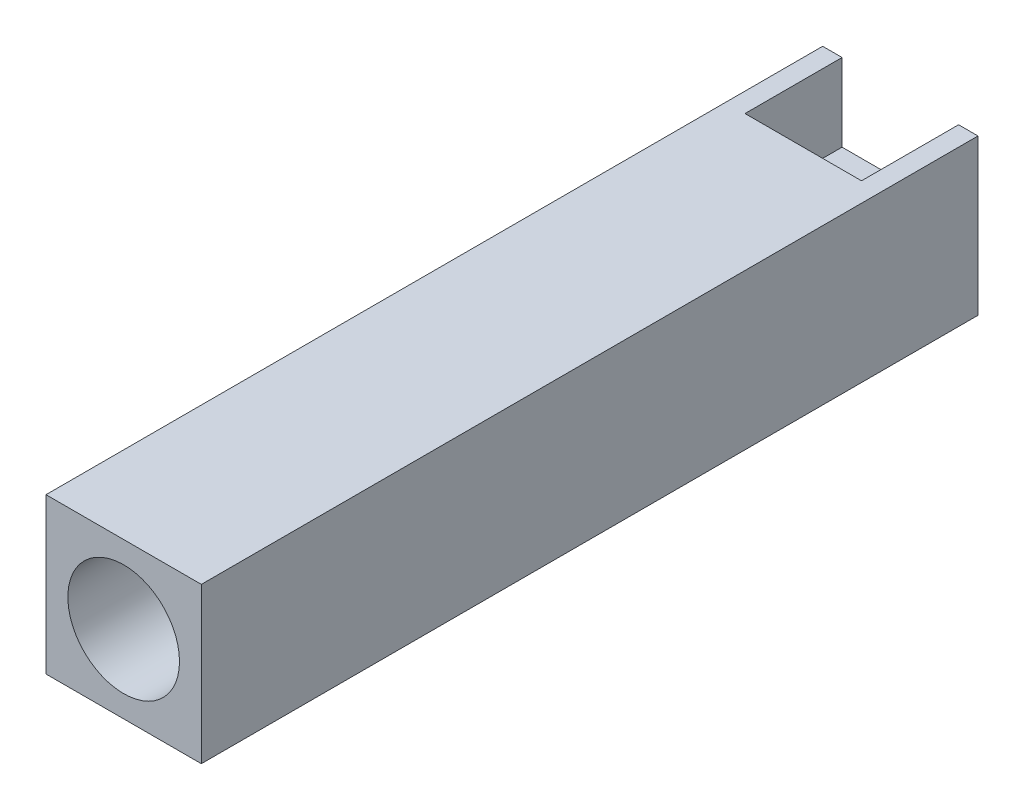
ISO-10303-21;
HEADER;
FILE_DESCRIPTION(('STEP AP214'),'2;1');
FILE_NAME('part.step','',(''),(''),'','','');
FILE_SCHEMA(('AUTOMOTIVE_DESIGN { 1 0 10303 214 1 1 1 1 }'));
ENDSEC;
DATA;
#1=APPLICATION_CONTEXT('core data for automotive mechanical design processes');
#2=APPLICATION_PROTOCOL_DEFINITION('international standard','automotive_design',2000,#1);
#3=PRODUCT_CONTEXT('',#1,'mechanical');
#4=PRODUCT('Part','Part','',(#3));
#5=PRODUCT_RELATED_PRODUCT_CATEGORY('part','',(#4));
#6=PRODUCT_DEFINITION_FORMATION('','',#4);
#7=PRODUCT_DEFINITION_CONTEXT('part definition',#1,'design');
#8=PRODUCT_DEFINITION('design','',#6,#7);
#9=PRODUCT_DEFINITION_SHAPE('','',#8);
#10=(LENGTH_UNIT() NAMED_UNIT(*) SI_UNIT(.MILLI.,.METRE.));
#11=(NAMED_UNIT(*) PLANE_ANGLE_UNIT() SI_UNIT($,.RADIAN.));
#12=(NAMED_UNIT(*) SI_UNIT($,.STERADIAN.) SOLID_ANGLE_UNIT());
#13=UNCERTAINTY_MEASURE_WITH_UNIT(LENGTH_MEASURE(1.E-05),#10,'distance_accuracy_value','');
#14=(GEOMETRIC_REPRESENTATION_CONTEXT(3) GLOBAL_UNCERTAINTY_ASSIGNED_CONTEXT((#13)) GLOBAL_UNIT_ASSIGNED_CONTEXT((#10,
#11,#12)) REPRESENTATION_CONTEXT('',''));
#15=CARTESIAN_POINT('',(0.,0.,0.));
#16=DIRECTION('',(0.,0.,1.));
#17=DIRECTION('',(1.,0.,0.));
#18=AXIS2_PLACEMENT_3D('',#15,#16,#17);
#19=CARTESIAN_POINT('',(0.,0.,80.));
#20=DIRECTION('',(1.,0.,0.));
#21=DIRECTION('',(0.,1.,0.));
#22=AXIS2_PLACEMENT_3D('',#19,#20,#21);
#23=PLANE('',#22);
#24=DIRECTION('',(0.,-1.,0.));
#25=VECTOR('',#24,1.);
#26=CARTESIAN_POINT('',(0.,0.,0.));
#27=LINE('',#26,#25);
#28=CARTESIAN_POINT('',(0.,0.,0.));
#29=VERTEX_POINT('',#28);
#30=CARTESIAN_POINT('',(0.,-16.,0.));
#31=VERTEX_POINT('',#30);
#32=EDGE_CURVE('E221',#29,#31,#27,.T.);
#33=ORIENTED_EDGE('',*,*,#32,.T.);
#34=DIRECTION('',(0.,0.,-1.));
#35=VECTOR('',#34,1.);
#36=CARTESIAN_POINT('',(0.,-16.,80.));
#37=LINE('',#36,#35);
#38=CARTESIAN_POINT('',(0.,-16.,80.));
#39=VERTEX_POINT('',#38);
#40=EDGE_CURVE('E11',#39,#31,#37,.T.);
#41=ORIENTED_EDGE('',*,*,#40,.F.);
#42=DIRECTION('',(0.,-1.,0.));
#43=VECTOR('',#42,1.);
#44=CARTESIAN_POINT('',(0.,0.,80.));
#45=LINE('',#44,#43);
#46=CARTESIAN_POINT('',(0.,0.,80.));
#47=VERTEX_POINT('',#46);
#48=EDGE_CURVE('E225',#47,#39,#45,.T.);
#49=ORIENTED_EDGE('',*,*,#48,.F.);
#50=DIRECTION('',(0.,0.,-1.));
#51=VECTOR('',#50,1.);
#52=CARTESIAN_POINT('',(0.,0.,80.));
#53=LINE('',#52,#51);
#54=EDGE_CURVE('E239',#47,#29,#53,.T.);
#55=ORIENTED_EDGE('',*,*,#54,.T.);
#56=EDGE_LOOP('',(#33,#41,#49,#55));
#57=FACE_BOUND('',#56,.T.);
#58=ADVANCED_FACE('F39',(#57),#23,.F.);
#59=CARTESIAN_POINT('',(0.,-16.,80.));
#60=DIRECTION('',(0.,1.,0.));
#61=DIRECTION('',(0.,0.,1.));
#62=AXIS2_PLACEMENT_3D('',#59,#60,#61);
#63=PLANE('',#62);
#64=DIRECTION('',(1.,0.,0.));
#65=VECTOR('',#64,1.);
#66=CARTESIAN_POINT('',(0.,-16.,0.));
#67=LINE('',#66,#65);
#68=CARTESIAN_POINT('',(2.,-16.,0.));
#69=VERTEX_POINT('',#68);
#70=EDGE_CURVE('E244',#31,#69,#67,.T.);
#71=ORIENTED_EDGE('',*,*,#70,.T.);
#72=DIRECTION('',(0.,0.,-1.));
#73=VECTOR('',#72,1.);
#74=CARTESIAN_POINT('',(2.,-16.,10.));
#75=LINE('',#74,#73);
#76=CARTESIAN_POINT('',(2.,-16.,10.));
#77=VERTEX_POINT('',#76);
#78=EDGE_CURVE('E166',#77,#69,#75,.T.);
#79=ORIENTED_EDGE('',*,*,#78,.F.);
#80=DIRECTION('',(-1.,0.,0.));
#81=VECTOR('',#80,1.);
#82=CARTESIAN_POINT('',(14.,-16.,10.));
#83=LINE('',#82,#81);
#84=CARTESIAN_POINT('',(14.,-16.,10.));
#85=VERTEX_POINT('',#84);
#86=EDGE_CURVE('E192',#85,#77,#83,.T.);
#87=ORIENTED_EDGE('',*,*,#86,.F.);
#88=DIRECTION('',(0.,0.,-1.));
#89=VECTOR('',#88,1.);
#90=CARTESIAN_POINT('',(14.,-16.,10.));
#91=LINE('',#90,#89);
#92=CARTESIAN_POINT('',(14.,-16.,0.));
#93=VERTEX_POINT('',#92);
#94=EDGE_CURVE('E208',#85,#93,#91,.T.);
#95=ORIENTED_EDGE('',*,*,#94,.T.);
#96=CARTESIAN_POINT('',(16.,-16.,0.));
#97=VERTEX_POINT('',#96);
#98=EDGE_CURVE('E243',#93,#97,#67,.T.);
#99=ORIENTED_EDGE('',*,*,#98,.T.);
#100=DIRECTION('',(0.,0.,-1.));
#101=VECTOR('',#100,1.);
#102=CARTESIAN_POINT('',(16.,-16.,80.));
#103=LINE('',#102,#101);
#104=CARTESIAN_POINT('',(16.,-16.,80.));
#105=VERTEX_POINT('',#104);
#106=EDGE_CURVE('E47',#105,#97,#103,.T.);
#107=ORIENTED_EDGE('',*,*,#106,.F.);
#108=DIRECTION('',(1.,0.,0.));
#109=VECTOR('',#108,1.);
#110=CARTESIAN_POINT('',(0.,-16.,80.));
#111=LINE('',#110,#109);
#112=EDGE_CURVE('E229',#39,#105,#111,.T.);
#113=ORIENTED_EDGE('',*,*,#112,.F.);
#114=ORIENTED_EDGE('',*,*,#40,.T.);
#115=EDGE_LOOP('',(#71,#79,#87,#95,#99,#107,#113,#114));
#116=FACE_BOUND('',#115,.T.);
#117=ADVANCED_FACE('F283',(#116),#63,.F.);
#118=CARTESIAN_POINT('',(16.,0.,80.));
#119=DIRECTION('',(-1.,0.,0.));
#120=DIRECTION('',(0.,-1.,0.));
#121=AXIS2_PLACEMENT_3D('',#118,#119,#120);
#122=PLANE('',#121);
#123=DIRECTION('',(0.,1.,0.));
#124=VECTOR('',#123,1.);
#125=CARTESIAN_POINT('',(16.,0.,0.));
#126=LINE('',#125,#124);
#127=CARTESIAN_POINT('',(16.,0.,0.));
#128=VERTEX_POINT('',#127);
#129=EDGE_CURVE('E248',#97,#128,#126,.T.);
#130=ORIENTED_EDGE('',*,*,#129,.T.);
#131=DIRECTION('',(0.,0.,-1.));
#132=VECTOR('',#131,1.);
#133=CARTESIAN_POINT('',(16.,0.,80.));
#134=LINE('',#133,#132);
#135=CARTESIAN_POINT('',(16.,0.,80.));
#136=VERTEX_POINT('',#135);
#137=EDGE_CURVE('E258',#136,#128,#134,.T.);
#138=ORIENTED_EDGE('',*,*,#137,.F.);
#139=DIRECTION('',(0.,1.,0.));
#140=VECTOR('',#139,1.);
#141=CARTESIAN_POINT('',(16.,0.,80.));
#142=LINE('',#141,#140);
#143=EDGE_CURVE('E233',#105,#136,#142,.T.);
#144=ORIENTED_EDGE('',*,*,#143,.F.);
#145=ORIENTED_EDGE('',*,*,#106,.T.);
#146=EDGE_LOOP('',(#130,#138,#144,#145));
#147=FACE_BOUND('',#146,.T.);
#148=ADVANCED_FACE('F267',(#147),#122,.F.);
#149=CARTESIAN_POINT('',(0.,0.,80.));
#150=DIRECTION('',(0.,-1.,0.));
#151=DIRECTION('',(0.,0.,-1.));
#152=AXIS2_PLACEMENT_3D('',#149,#150,#151);
#153=PLANE('',#152);
#154=DIRECTION('',(-1.,0.,0.));
#155=VECTOR('',#154,1.);
#156=CARTESIAN_POINT('',(0.,0.,0.));
#157=LINE('',#156,#155);
#158=CARTESIAN_POINT('',(14.,0.,0.));
#159=VERTEX_POINT('',#158);
#160=EDGE_CURVE('E230',#128,#159,#157,.T.);
#161=ORIENTED_EDGE('',*,*,#160,.T.);
#162=DIRECTION('',(0.,0.,-1.));
#163=VECTOR('',#162,1.);
#164=CARTESIAN_POINT('',(14.,0.,10.));
#165=LINE('',#164,#163);
#166=CARTESIAN_POINT('',(14.,0.,10.));
#167=VERTEX_POINT('',#166);
#168=EDGE_CURVE('E169',#167,#159,#165,.T.);
#169=ORIENTED_EDGE('',*,*,#168,.F.);
#170=DIRECTION('',(1.,0.,0.));
#171=VECTOR('',#170,1.);
#172=CARTESIAN_POINT('',(14.,0.,10.));
#173=LINE('',#172,#171);
#174=CARTESIAN_POINT('',(2.,0.,10.));
#175=VERTEX_POINT('',#174);
#176=EDGE_CURVE('E136',#175,#167,#173,.T.);
#177=ORIENTED_EDGE('',*,*,#176,.F.);
#178=DIRECTION('',(0.,0.,-1.));
#179=VECTOR('',#178,1.);
#180=CARTESIAN_POINT('',(2.,0.,10.));
#181=LINE('',#180,#179);
#182=CARTESIAN_POINT('',(2.,0.,0.));
#183=VERTEX_POINT('',#182);
#184=EDGE_CURVE('E173',#175,#183,#181,.T.);
#185=ORIENTED_EDGE('',*,*,#184,.T.);
#186=EDGE_CURVE('E251',#183,#29,#157,.T.);
#187=ORIENTED_EDGE('',*,*,#186,.T.);
#188=ORIENTED_EDGE('',*,*,#54,.F.);
#189=DIRECTION('',(-1.,0.,0.));
#190=VECTOR('',#189,1.);
#191=CARTESIAN_POINT('',(0.,0.,80.));
#192=LINE('',#191,#190);
#193=EDGE_CURVE('E236',#136,#47,#192,.T.);
#194=ORIENTED_EDGE('',*,*,#193,.F.);
#195=ORIENTED_EDGE('',*,*,#137,.T.);
#196=EDGE_LOOP('',(#161,#169,#177,#185,#187,#188,#194,#195));
#197=FACE_BOUND('',#196,.T.);
#198=ADVANCED_FACE('F276',(#197),#153,.F.);
#199=CARTESIAN_POINT('',(0.,0.,80.));
#200=DIRECTION('',(0.,0.,1.));
#201=DIRECTION('',(1.,0.,0.));
#202=AXIS2_PLACEMENT_3D('',#199,#200,#201);
#203=PLANE('',#202);
#204=CARTESIAN_POINT('',(8.,-8.,80.));
#205=DIRECTION('',(0.,0.,1.));
#206=DIRECTION('',(1.,0.,0.));
#207=AXIS2_PLACEMENT_3D('',#204,#205,#206);
#208=CIRCLE('',#207,5.75);
#209=CARTESIAN_POINT('',(13.75,-8.,80.));
#210=VERTEX_POINT('',#209);
#211=EDGE_CURVE('E172',#210,#210,#208,.T.);
#212=ORIENTED_EDGE('',*,*,#211,.F.);
#213=EDGE_LOOP('',(#212));
#214=FACE_BOUND('',#213,.T.);
#215=ORIENTED_EDGE('',*,*,#48,.T.);
#216=ORIENTED_EDGE('',*,*,#112,.T.);
#217=ORIENTED_EDGE('',*,*,#143,.T.);
#218=ORIENTED_EDGE('',*,*,#193,.T.);
#219=EDGE_LOOP('',(#215,#216,#217,#218));
#220=FACE_BOUND('',#219,.T.);
#221=ADVANCED_FACE('F281',(#214,#220),#203,.T.);
#222=CARTESIAN_POINT('',(0.,0.,0.));
#223=DIRECTION('',(0.,0.,1.));
#224=DIRECTION('',(1.,0.,0.));
#225=AXIS2_PLACEMENT_3D('',#222,#223,#224);
#226=PLANE('',#225);
#227=DIRECTION('',(-1.,0.,0.));
#228=VECTOR('',#227,1.);
#229=CARTESIAN_POINT('',(14.,-8.,0.));
#230=LINE('',#229,#228);
#231=CARTESIAN_POINT('',(14.,-8.,0.));
#232=VERTEX_POINT('',#231);
#233=CARTESIAN_POINT('',(2.,-8.,0.));
#234=VERTEX_POINT('',#233);
#235=EDGE_CURVE('E154',#232,#234,#230,.T.);
#236=ORIENTED_EDGE('',*,*,#235,.F.);
#237=DIRECTION('',(0.,-1.,0.));
#238=VECTOR('',#237,1.);
#239=CARTESIAN_POINT('',(14.,0.,0.));
#240=LINE('',#239,#238);
#241=EDGE_CURVE('E54',#159,#232,#240,.T.);
#242=ORIENTED_EDGE('',*,*,#241,.F.);
#243=ORIENTED_EDGE('',*,*,#160,.F.);
#244=ORIENTED_EDGE('',*,*,#129,.F.);
#245=ORIENTED_EDGE('',*,*,#98,.F.);
#246=DIRECTION('',(0.,-1.,0.));
#247=VECTOR('',#246,1.);
#248=CARTESIAN_POINT('',(14.,-13.,0.));
#249=LINE('',#248,#247);
#250=CARTESIAN_POINT('',(14.,-13.,0.));
#251=VERTEX_POINT('',#250);
#252=EDGE_CURVE('E184',#251,#93,#249,.T.);
#253=ORIENTED_EDGE('',*,*,#252,.F.);
#254=DIRECTION('',(1.,0.,0.));
#255=VECTOR('',#254,1.);
#256=CARTESIAN_POINT('',(14.,-13.,0.));
#257=LINE('',#256,#255);
#258=CARTESIAN_POINT('',(2.,-13.,0.));
#259=VERTEX_POINT('',#258);
#260=EDGE_CURVE('E199',#259,#251,#257,.T.);
#261=ORIENTED_EDGE('',*,*,#260,.F.);
#262=DIRECTION('',(0.,1.,0.));
#263=VECTOR('',#262,1.);
#264=CARTESIAN_POINT('',(2.,-13.,0.));
#265=LINE('',#264,#263);
#266=EDGE_CURVE('E62',#69,#259,#265,.T.);
#267=ORIENTED_EDGE('',*,*,#266,.F.);
#268=ORIENTED_EDGE('',*,*,#70,.F.);
#269=ORIENTED_EDGE('',*,*,#32,.F.);
#270=ORIENTED_EDGE('',*,*,#186,.F.);
#271=DIRECTION('',(0.,1.,0.));
#272=VECTOR('',#271,1.);
#273=CARTESIAN_POINT('',(2.,0.,0.));
#274=LINE('',#273,#272);
#275=EDGE_CURVE('E151',#234,#183,#274,.T.);
#276=ORIENTED_EDGE('',*,*,#275,.F.);
#277=EDGE_LOOP('',(#236,#242,#243,#244,#245,#253,#261,#267,#268,#269,#270,#276));
#278=FACE_BOUND('',#277,.T.);
#279=ADVANCED_FACE('F273',(#278),#226,.F.);
#280=CARTESIAN_POINT('',(8.,-8.,30.));
#281=DIRECTION('',(0.,0.,1.));
#282=DIRECTION('',(1.,0.,0.));
#283=AXIS2_PLACEMENT_3D('',#280,#281,#282);
#284=CYLINDRICAL_SURFACE('',#283,5.75);
#285=CARTESIAN_POINT('',(8.,-8.,30.));
#286=DIRECTION('',(0.,0.,1.));
#287=DIRECTION('',(1.,0.,0.));
#288=AXIS2_PLACEMENT_3D('',#285,#286,#287);
#289=CIRCLE('',#288,5.75);
#290=CARTESIAN_POINT('',(13.75,-8.,30.));
#291=VERTEX_POINT('',#290);
#292=EDGE_CURVE('E217',#291,#291,#289,.T.);
#293=ORIENTED_EDGE('',*,*,#292,.F.);
#294=EDGE_LOOP('',(#293));
#295=FACE_BOUND('',#294,.T.);
#296=ORIENTED_EDGE('',*,*,#211,.T.);
#297=EDGE_LOOP('',(#296));
#298=FACE_BOUND('',#297,.T.);
#299=ADVANCED_FACE('F324',(#295,#298),#284,.F.);
#300=CARTESIAN_POINT('',(8.,-8.,30.));
#301=DIRECTION('',(0.,0.,1.));
#302=DIRECTION('',(1.,0.,0.));
#303=AXIS2_PLACEMENT_3D('',#300,#301,#302);
#304=PLANE('',#303);
#305=ORIENTED_EDGE('',*,*,#292,.T.);
#306=EDGE_LOOP('',(#305));
#307=FACE_BOUND('',#306,.T.);
#308=ADVANCED_FACE('F308',(#307),#304,.T.);
#309=CARTESIAN_POINT('',(2.,-13.,10.));
#310=DIRECTION('',(-1.,0.,0.));
#311=DIRECTION('',(0.,0.,1.));
#312=AXIS2_PLACEMENT_3D('',#309,#310,#311);
#313=PLANE('',#312);
#314=ORIENTED_EDGE('',*,*,#266,.T.);
#315=DIRECTION('',(0.,0.,-1.));
#316=VECTOR('',#315,1.);
#317=CARTESIAN_POINT('',(2.,-13.,10.));
#318=LINE('',#317,#316);
#319=CARTESIAN_POINT('',(2.,-13.,10.));
#320=VERTEX_POINT('',#319);
#321=EDGE_CURVE('E196',#320,#259,#318,.T.);
#322=ORIENTED_EDGE('',*,*,#321,.F.);
#323=DIRECTION('',(0.,1.,0.));
#324=VECTOR('',#323,1.);
#325=CARTESIAN_POINT('',(2.,-13.,10.));
#326=LINE('',#325,#324);
#327=EDGE_CURVE('E179',#77,#320,#326,.T.);
#328=ORIENTED_EDGE('',*,*,#327,.F.);
#329=ORIENTED_EDGE('',*,*,#78,.T.);
#330=EDGE_LOOP('',(#314,#322,#328,#329));
#331=FACE_BOUND('',#330,.T.);
#332=ADVANCED_FACE('F294',(#331),#313,.F.);
#333=CARTESIAN_POINT('',(14.,-13.,10.));
#334=DIRECTION('',(1.,0.,0.));
#335=DIRECTION('',(0.,0.,-1.));
#336=AXIS2_PLACEMENT_3D('',#333,#334,#335);
#337=PLANE('',#336);
#338=ORIENTED_EDGE('',*,*,#252,.T.);
#339=ORIENTED_EDGE('',*,*,#94,.F.);
#340=DIRECTION('',(0.,-1.,0.));
#341=VECTOR('',#340,1.);
#342=CARTESIAN_POINT('',(14.,-13.,10.));
#343=LINE('',#342,#341);
#344=CARTESIAN_POINT('',(14.,-13.,10.));
#345=VERTEX_POINT('',#344);
#346=EDGE_CURVE('E188',#345,#85,#343,.T.);
#347=ORIENTED_EDGE('',*,*,#346,.F.);
#348=DIRECTION('',(0.,0.,-1.));
#349=VECTOR('',#348,1.);
#350=CARTESIAN_POINT('',(14.,-13.,10.));
#351=LINE('',#350,#349);
#352=EDGE_CURVE('E212',#345,#251,#351,.T.);
#353=ORIENTED_EDGE('',*,*,#352,.T.);
#354=EDGE_LOOP('',(#338,#339,#347,#353));
#355=FACE_BOUND('',#354,.T.);
#356=ADVANCED_FACE('F299',(#355),#337,.F.);
#357=CARTESIAN_POINT('',(14.,-13.,10.));
#358=DIRECTION('',(0.,1.,0.));
#359=DIRECTION('',(0.,0.,1.));
#360=AXIS2_PLACEMENT_3D('',#357,#358,#359);
#361=PLANE('',#360);
#362=CARTESIAN_POINT('',(8.,-13.,5.));
#363=DIRECTION('',(0.,-1.,0.));
#364=DIRECTION('',(0.,0.,-1.));
#365=AXIS2_PLACEMENT_3D('',#362,#363,#364);
#366=CIRCLE('',#365,3.25);
#367=CARTESIAN_POINT('',(8.,-13.,1.75));
#368=VERTEX_POINT('',#367);
#369=EDGE_CURVE('E157',#368,#368,#366,.T.);
#370=ORIENTED_EDGE('',*,*,#369,.F.);
#371=EDGE_LOOP('',(#370));
#372=FACE_BOUND('',#371,.T.);
#373=ORIENTED_EDGE('',*,*,#260,.T.);
#374=ORIENTED_EDGE('',*,*,#352,.F.);
#375=DIRECTION('',(1.,0.,0.));
#376=VECTOR('',#375,1.);
#377=CARTESIAN_POINT('',(14.,-13.,10.));
#378=LINE('',#377,#376);
#379=EDGE_CURVE('E183',#320,#345,#378,.T.);
#380=ORIENTED_EDGE('',*,*,#379,.F.);
#381=ORIENTED_EDGE('',*,*,#321,.T.);
#382=EDGE_LOOP('',(#373,#374,#380,#381));
#383=FACE_BOUND('',#382,.T.);
#384=ADVANCED_FACE('F291',(#372,#383),#361,.F.);
#385=CARTESIAN_POINT('',(0.,0.,10.));
#386=DIRECTION('',(0.,0.,-1.));
#387=DIRECTION('',(-1.,0.,0.));
#388=AXIS2_PLACEMENT_3D('',#385,#386,#387);
#389=PLANE('',#388);
#390=ORIENTED_EDGE('',*,*,#327,.T.);
#391=ORIENTED_EDGE('',*,*,#379,.T.);
#392=ORIENTED_EDGE('',*,*,#346,.T.);
#393=ORIENTED_EDGE('',*,*,#86,.T.);
#394=EDGE_LOOP('',(#390,#391,#392,#393));
#395=FACE_BOUND('',#394,.T.);
#396=ADVANCED_FACE('F297',(#395),#389,.T.);
#397=CARTESIAN_POINT('',(14.,0.,10.));
#398=DIRECTION('',(1.,0.,0.));
#399=DIRECTION('',(0.,1.,0.));
#400=AXIS2_PLACEMENT_3D('',#397,#398,#399);
#401=PLANE('',#400);
#402=ORIENTED_EDGE('',*,*,#241,.T.);
#403=DIRECTION('',(0.,0.,-1.));
#404=VECTOR('',#403,1.);
#405=CARTESIAN_POINT('',(14.,-8.,10.));
#406=LINE('',#405,#404);
#407=CARTESIAN_POINT('',(14.,-8.,10.));
#408=VERTEX_POINT('',#407);
#409=EDGE_CURVE('E125',#408,#232,#406,.T.);
#410=ORIENTED_EDGE('',*,*,#409,.F.);
#411=DIRECTION('',(0.,-1.,0.));
#412=VECTOR('',#411,1.);
#413=CARTESIAN_POINT('',(14.,0.,10.));
#414=LINE('',#413,#412);
#415=EDGE_CURVE('E129',#167,#408,#414,.T.);
#416=ORIENTED_EDGE('',*,*,#415,.F.);
#417=ORIENTED_EDGE('',*,*,#168,.T.);
#418=EDGE_LOOP('',(#402,#410,#416,#417));
#419=FACE_BOUND('',#418,.T.);
#420=ADVANCED_FACE('F127',(#419),#401,.F.);
#421=CARTESIAN_POINT('',(2.,0.,10.));
#422=DIRECTION('',(-1.,0.,0.));
#423=DIRECTION('',(0.,-1.,0.));
#424=AXIS2_PLACEMENT_3D('',#421,#422,#423);
#425=PLANE('',#424);
#426=ORIENTED_EDGE('',*,*,#275,.T.);
#427=ORIENTED_EDGE('',*,*,#184,.F.);
#428=DIRECTION('',(0.,1.,0.));
#429=VECTOR('',#428,1.);
#430=CARTESIAN_POINT('',(2.,0.,10.));
#431=LINE('',#430,#429);
#432=CARTESIAN_POINT('',(2.,-8.,10.));
#433=VERTEX_POINT('',#432);
#434=EDGE_CURVE('E145',#433,#175,#431,.T.);
#435=ORIENTED_EDGE('',*,*,#434,.F.);
#436=DIRECTION('',(0.,0.,-1.));
#437=VECTOR('',#436,1.);
#438=CARTESIAN_POINT('',(2.,-8.,10.));
#439=LINE('',#438,#437);
#440=EDGE_CURVE('E135',#433,#234,#439,.T.);
#441=ORIENTED_EDGE('',*,*,#440,.T.);
#442=EDGE_LOOP('',(#426,#427,#435,#441));
#443=FACE_BOUND('',#442,.T.);
#444=ADVANCED_FACE('F369',(#443),#425,.F.);
#445=CARTESIAN_POINT('',(14.,-8.,10.));
#446=DIRECTION('',(0.,-1.,0.));
#447=DIRECTION('',(0.,0.,-1.));
#448=AXIS2_PLACEMENT_3D('',#445,#446,#447);
#449=PLANE('',#448);
#450=CARTESIAN_POINT('',(8.,-8.,5.));
#451=DIRECTION('',(0.,-1.,0.));
#452=DIRECTION('',(0.,0.,-1.));
#453=AXIS2_PLACEMENT_3D('',#450,#451,#452);
#454=CIRCLE('',#453,1.64999999999999);
#455=CARTESIAN_POINT('',(8.,-8.,3.35000000000001));
#456=VERTEX_POINT('',#455);
#457=EDGE_CURVE('E437',#456,#456,#454,.T.);
#458=ORIENTED_EDGE('',*,*,#457,.T.);
#459=EDGE_LOOP('',(#458));
#460=FACE_BOUND('',#459,.T.);
#461=ORIENTED_EDGE('',*,*,#235,.T.);
#462=ORIENTED_EDGE('',*,*,#440,.F.);
#463=DIRECTION('',(-1.,0.,0.));
#464=VECTOR('',#463,1.);
#465=CARTESIAN_POINT('',(14.,-8.,10.));
#466=LINE('',#465,#464);
#467=EDGE_CURVE('E139',#408,#433,#466,.T.);
#468=ORIENTED_EDGE('',*,*,#467,.F.);
#469=ORIENTED_EDGE('',*,*,#409,.T.);
#470=EDGE_LOOP('',(#461,#462,#468,#469));
#471=FACE_BOUND('',#470,.T.);
#472=ADVANCED_FACE('F140',(#460,#471),#449,.F.);
#473=CARTESIAN_POINT('',(0.,0.,10.));
#474=DIRECTION('',(0.,0.,-1.));
#475=DIRECTION('',(-1.,0.,0.));
#476=AXIS2_PLACEMENT_3D('',#473,#474,#475);
#477=PLANE('',#476);
#478=ORIENTED_EDGE('',*,*,#415,.T.);
#479=ORIENTED_EDGE('',*,*,#467,.T.);
#480=ORIENTED_EDGE('',*,*,#434,.T.);
#481=ORIENTED_EDGE('',*,*,#176,.T.);
#482=EDGE_LOOP('',(#478,#479,#480,#481));
#483=FACE_BOUND('',#482,.T.);
#484=ADVANCED_FACE('F147',(#483),#477,.T.);
#485=CARTESIAN_POINT('',(8.,-12.,5.));
#486=DIRECTION('',(0.,-1.,0.));
#487=DIRECTION('',(0.,0.,-1.));
#488=AXIS2_PLACEMENT_3D('',#485,#486,#487);
#489=CYLINDRICAL_SURFACE('',#488,3.25);
#490=CARTESIAN_POINT('',(8.,-12.,5.));
#491=DIRECTION('',(0.,-1.,0.));
#492=DIRECTION('',(0.,0.,-1.));
#493=AXIS2_PLACEMENT_3D('',#490,#491,#492);
#494=CIRCLE('',#493,3.25);
#495=CARTESIAN_POINT('',(8.,-12.,1.75));
#496=VERTEX_POINT('',#495);
#497=EDGE_CURVE('E200',#496,#496,#494,.T.);
#498=ORIENTED_EDGE('',*,*,#497,.F.);
#499=EDGE_LOOP('',(#498));
#500=FACE_BOUND('',#499,.T.);
#501=ORIENTED_EDGE('',*,*,#369,.T.);
#502=EDGE_LOOP('',(#501));
#503=FACE_BOUND('',#502,.T.);
#504=ADVANCED_FACE('F389',(#500,#503),#489,.F.);
#505=CARTESIAN_POINT('',(8.,-12.,5.));
#506=DIRECTION('',(0.,-1.,0.));
#507=DIRECTION('',(0.,0.,-1.));
#508=AXIS2_PLACEMENT_3D('',#505,#506,#507);
#509=PLANE('',#508);
#510=CARTESIAN_POINT('',(8.,-12.,5.));
#511=DIRECTION('',(0.,-1.,0.));
#512=DIRECTION('',(0.,0.,-1.));
#513=AXIS2_PLACEMENT_3D('',#510,#511,#512);
#514=CIRCLE('',#513,1.64999999999999);
#515=CARTESIAN_POINT('',(8.,-12.,3.35000000000001));
#516=VERTEX_POINT('',#515);
#517=EDGE_CURVE('E440',#516,#516,#514,.T.);
#518=ORIENTED_EDGE('',*,*,#517,.F.);
#519=EDGE_LOOP('',(#518));
#520=FACE_BOUND('',#519,.T.);
#521=ORIENTED_EDGE('',*,*,#497,.T.);
#522=EDGE_LOOP('',(#521));
#523=FACE_BOUND('',#522,.T.);
#524=ADVANCED_FACE('F403',(#520,#523),#509,.T.);
#525=CARTESIAN_POINT('',(8.,-12.,5.));
#526=DIRECTION('',(0.,-1.,0.));
#527=DIRECTION('',(0.,0.,-1.));
#528=AXIS2_PLACEMENT_3D('',#525,#526,#527);
#529=CYLINDRICAL_SURFACE('',#528,1.64999999999999);
#530=ORIENTED_EDGE('',*,*,#457,.F.);
#531=EDGE_LOOP('',(#530));
#532=FACE_BOUND('',#531,.T.);
#533=ORIENTED_EDGE('',*,*,#517,.T.);
#534=EDGE_LOOP('',(#533));
#535=FACE_BOUND('',#534,.T.);
#536=ADVANCED_FACE('F420',(#532,#535),#529,.F.);
#537=CLOSED_SHELL('',(#58,#117,#148,#198,#221,#279,#299,#308,#332,#356,#384,#396,#420,#444,#472,
#484,#504,#524,#536));
#538=MANIFOLD_SOLID_BREP('B2',#537);
#539=ADVANCED_BREP_SHAPE_REPRESENTATION('',(#18,#538),#14);
#540=SHAPE_DEFINITION_REPRESENTATION(#9,#539);
ENDSEC;
END-ISO-10303-21;
